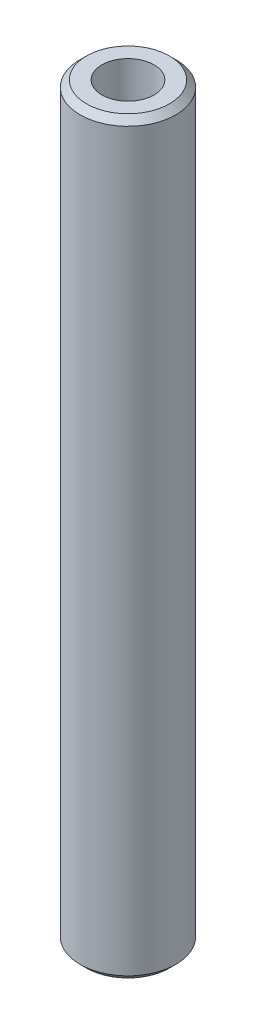
ISO-10303-21;
HEADER;
FILE_DESCRIPTION(('STEP AP214'),'2;1');
FILE_NAME('part.step','',(''),(''),'','','');
FILE_SCHEMA(('AUTOMOTIVE_DESIGN { 1 0 10303 214 1 1 1 1 }'));
ENDSEC;
DATA;
#1=APPLICATION_CONTEXT('core data for automotive mechanical design processes');
#2=APPLICATION_PROTOCOL_DEFINITION('international standard','automotive_design',2000,#1);
#3=PRODUCT_CONTEXT('',#1,'mechanical');
#4=PRODUCT('Part','Part','',(#3));
#5=PRODUCT_RELATED_PRODUCT_CATEGORY('part','',(#4));
#6=PRODUCT_DEFINITION_FORMATION('','',#4);
#7=PRODUCT_DEFINITION_CONTEXT('part definition',#1,'design');
#8=PRODUCT_DEFINITION('design','',#6,#7);
#9=PRODUCT_DEFINITION_SHAPE('','',#8);
#10=(LENGTH_UNIT() NAMED_UNIT(*) SI_UNIT(.MILLI.,.METRE.));
#11=(NAMED_UNIT(*) PLANE_ANGLE_UNIT() SI_UNIT($,.RADIAN.));
#12=(NAMED_UNIT(*) SI_UNIT($,.STERADIAN.) SOLID_ANGLE_UNIT());
#13=UNCERTAINTY_MEASURE_WITH_UNIT(LENGTH_MEASURE(1.E-05),#10,'distance_accuracy_value','');
#14=(GEOMETRIC_REPRESENTATION_CONTEXT(3) GLOBAL_UNCERTAINTY_ASSIGNED_CONTEXT((#13)) GLOBAL_UNIT_ASSIGNED_CONTEXT((#10,
#11,#12)) REPRESENTATION_CONTEXT('',''));
#15=CARTESIAN_POINT('',(0.,0.,0.));
#16=DIRECTION('',(0.,0.,1.));
#17=DIRECTION('',(1.,0.,0.));
#18=AXIS2_PLACEMENT_3D('',#15,#16,#17);
#19=CARTESIAN_POINT('',(0.,234.536348477984,0.));
#20=DIRECTION('',(0.,-1.,0.));
#21=DIRECTION('',(0.,0.,-1.));
#22=AXIS2_PLACEMENT_3D('',#19,#20,#21);
#23=CYLINDRICAL_SURFACE('',#22,15.);
#24=CARTESIAN_POINT('',(0.,232.541925357969,0.));
#25=DIRECTION('',(0.,1.,0.));
#26=DIRECTION('',(0.,0.,1.));
#27=AXIS2_PLACEMENT_3D('',#24,#25,#26);
#28=CIRCLE('',#27,15.);
#29=CARTESIAN_POINT('',(0.,232.541925357969,15.));
#30=VERTEX_POINT('',#29);
#31=EDGE_CURVE('E50',#30,#30,#28,.F.);
#32=ORIENTED_EDGE('',*,*,#31,.T.);
#33=EDGE_LOOP('',(#32));
#34=FACE_BOUND('',#33,.T.);
#35=CARTESIAN_POINT('',(0.,1.99442312001485,0.));
#36=DIRECTION('',(0.,1.,0.));
#37=DIRECTION('',(0.,0.,1.));
#38=AXIS2_PLACEMENT_3D('',#35,#36,#37);
#39=CIRCLE('',#38,15.);
#40=CARTESIAN_POINT('',(0.,1.99442312001485,15.));
#41=VERTEX_POINT('',#40);
#42=EDGE_CURVE('E51',#41,#41,#39,.T.);
#43=ORIENTED_EDGE('',*,*,#42,.T.);
#44=EDGE_LOOP('',(#43));
#45=FACE_BOUND('',#44,.T.);
#46=ADVANCED_FACE('F39',(#34,#45),#23,.T.);
#47=CARTESIAN_POINT('',(0.,234.536348477984,0.));
#48=DIRECTION('',(0.,1.,0.));
#49=DIRECTION('',(0.,0.,1.));
#50=AXIS2_PLACEMENT_3D('',#47,#48,#49);
#51=PLANE('',#50);
#52=CARTESIAN_POINT('',(0.,234.536348477984,0.));
#53=DIRECTION('',(0.,1.,0.));
#54=DIRECTION('',(0.,0.,1.));
#55=AXIS2_PLACEMENT_3D('',#52,#53,#54);
#56=CIRCLE('',#55,13.0055768799852);
#57=CARTESIAN_POINT('',(0.,234.536348477984,13.0055768799852));
#58=VERTEX_POINT('',#57);
#59=EDGE_CURVE('E54',#58,#58,#56,.T.);
#60=ORIENTED_EDGE('',*,*,#59,.T.);
#61=EDGE_LOOP('',(#60));
#62=FACE_BOUND('',#61,.T.);
#63=CARTESIAN_POINT('',(0.,234.536348477984,0.));
#64=DIRECTION('',(0.,1.,0.));
#65=DIRECTION('',(0.,0.,1.));
#66=AXIS2_PLACEMENT_3D('',#63,#64,#65);
#67=CIRCLE('',#66,8.18067311446192);
#68=CARTESIAN_POINT('',(0.,234.536348477984,8.18067311446192));
#69=VERTEX_POINT('',#68);
#70=EDGE_CURVE('E58',#69,#69,#67,.T.);
#71=ORIENTED_EDGE('',*,*,#70,.F.);
#72=EDGE_LOOP('',(#71));
#73=FACE_BOUND('',#72,.T.);
#74=ADVANCED_FACE('F69',(#62,#73),#51,.T.);
#75=CARTESIAN_POINT('',(0.,0.,0.));
#76=DIRECTION('',(0.,1.,0.));
#77=DIRECTION('',(0.,0.,1.));
#78=AXIS2_PLACEMENT_3D('',#75,#76,#77);
#79=PLANE('',#78);
#80=CARTESIAN_POINT('',(0.,0.,0.));
#81=DIRECTION('',(0.,1.,0.));
#82=DIRECTION('',(0.,0.,1.));
#83=AXIS2_PLACEMENT_3D('',#80,#81,#82);
#84=CIRCLE('',#83,13.0055768799851);
#85=CARTESIAN_POINT('',(0.,0.,13.0055768799851));
#86=VERTEX_POINT('',#85);
#87=EDGE_CURVE('E10',#86,#86,#84,.F.);
#88=ORIENTED_EDGE('',*,*,#87,.T.);
#89=EDGE_LOOP('',(#88));
#90=FACE_BOUND('',#89,.T.);
#91=CARTESIAN_POINT('',(0.,0.,0.));
#92=DIRECTION('',(0.,1.,0.));
#93=DIRECTION('',(0.,0.,1.));
#94=AXIS2_PLACEMENT_3D('',#91,#92,#93);
#95=CIRCLE('',#94,8.18067311446192);
#96=CARTESIAN_POINT('',(0.,0.,8.18067311446192));
#97=VERTEX_POINT('',#96);
#98=EDGE_CURVE('E63',#97,#97,#95,.T.);
#99=ORIENTED_EDGE('',*,*,#98,.T.);
#100=EDGE_LOOP('',(#99));
#101=FACE_BOUND('',#100,.T.);
#102=ADVANCED_FACE('F75',(#90,#101),#79,.F.);
#103=CARTESIAN_POINT('',(0.,234.536348477984,0.));
#104=DIRECTION('',(0.,-1.,0.));
#105=DIRECTION('',(0.,0.,-1.));
#106=AXIS2_PLACEMENT_3D('',#103,#104,#105);
#107=CYLINDRICAL_SURFACE('',#106,8.18067311446192);
#108=ORIENTED_EDGE('',*,*,#70,.T.);
#109=EDGE_LOOP('',(#108));
#110=FACE_BOUND('',#109,.T.);
#111=ORIENTED_EDGE('',*,*,#98,.F.);
#112=EDGE_LOOP('',(#111));
#113=FACE_BOUND('',#112,.T.);
#114=ADVANCED_FACE('F70',(#110,#113),#107,.F.);
#115=CARTESIAN_POINT('',(0.,234.536348477984,0.));
#116=DIRECTION('',(0.,-1.,0.));
#117=DIRECTION('',(0.,0.,-1.));
#118=AXIS2_PLACEMENT_3D('',#115,#116,#117);
#119=CONICAL_SURFACE('',#118,13.0055768799852,0.785398163397445);
#120=ORIENTED_EDGE('',*,*,#31,.F.);
#121=EDGE_LOOP('',(#120));
#122=FACE_BOUND('',#121,.T.);
#123=ORIENTED_EDGE('',*,*,#59,.F.);
#124=EDGE_LOOP('',(#123));
#125=FACE_BOUND('',#124,.T.);
#126=ADVANCED_FACE('F81',(#122,#125),#119,.T.);
#127=CARTESIAN_POINT('',(0.,1.99442312001485,0.));
#128=DIRECTION('',(0.,1.,0.));
#129=DIRECTION('',(0.,0.,1.));
#130=AXIS2_PLACEMENT_3D('',#127,#128,#129);
#131=CONICAL_SURFACE('',#130,15.,0.785398163397452);
#132=ORIENTED_EDGE('',*,*,#87,.F.);
#133=EDGE_LOOP('',(#132));
#134=FACE_BOUND('',#133,.T.);
#135=ORIENTED_EDGE('',*,*,#42,.F.);
#136=EDGE_LOOP('',(#135));
#137=FACE_BOUND('',#136,.T.);
#138=ADVANCED_FACE('F45',(#134,#137),#131,.T.);
#139=CLOSED_SHELL('',(#46,#74,#102,#114,#126,#138));
#140=MANIFOLD_SOLID_BREP('B2',#139);
#141=ADVANCED_BREP_SHAPE_REPRESENTATION('',(#18,#140),#14);
#142=SHAPE_DEFINITION_REPRESENTATION(#9,#141);
ENDSEC;
END-ISO-10303-21;
